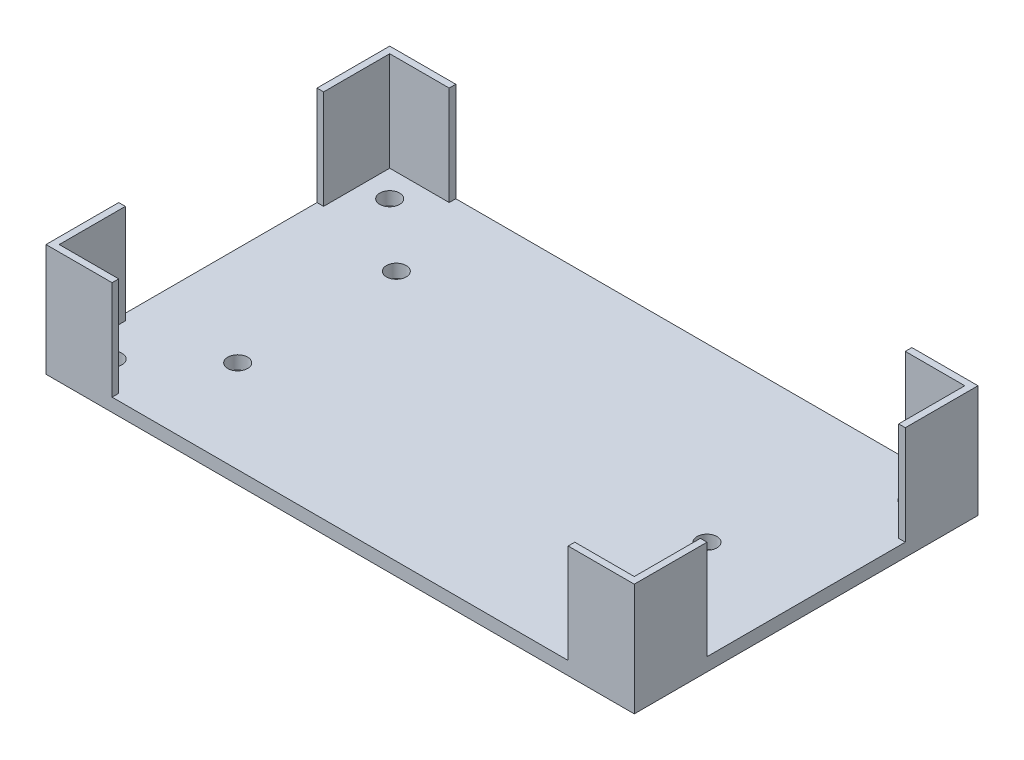
ISO-10303-21;
HEADER;
FILE_DESCRIPTION(('STEP AP214'),'2;1');
FILE_NAME('part.step','',(''),(''),'','','');
FILE_SCHEMA(('AUTOMOTIVE_DESIGN { 1 0 10303 214 1 1 1 1 }'));
ENDSEC;
DATA;
#1=APPLICATION_CONTEXT('core data for automotive mechanical design processes');
#2=APPLICATION_PROTOCOL_DEFINITION('international standard','automotive_design',2000,#1);
#3=PRODUCT_CONTEXT('',#1,'mechanical');
#4=PRODUCT('Part','Part','',(#3));
#5=PRODUCT_RELATED_PRODUCT_CATEGORY('part','',(#4));
#6=PRODUCT_DEFINITION_FORMATION('','',#4);
#7=PRODUCT_DEFINITION_CONTEXT('part definition',#1,'design');
#8=PRODUCT_DEFINITION('design','',#6,#7);
#9=PRODUCT_DEFINITION_SHAPE('','',#8);
#10=(LENGTH_UNIT() NAMED_UNIT(*) SI_UNIT(.MILLI.,.METRE.));
#11=(NAMED_UNIT(*) PLANE_ANGLE_UNIT() SI_UNIT($,.RADIAN.));
#12=(NAMED_UNIT(*) SI_UNIT($,.STERADIAN.) SOLID_ANGLE_UNIT());
#13=UNCERTAINTY_MEASURE_WITH_UNIT(LENGTH_MEASURE(1.E-05),#10,'distance_accuracy_value','');
#14=(GEOMETRIC_REPRESENTATION_CONTEXT(3) GLOBAL_UNCERTAINTY_ASSIGNED_CONTEXT((#13)) GLOBAL_UNIT_ASSIGNED_CONTEXT((#10,
#11,#12)) REPRESENTATION_CONTEXT('',''));
#15=CARTESIAN_POINT('',(0.,0.,0.));
#16=DIRECTION('',(0.,0.,1.));
#17=DIRECTION('',(1.,0.,0.));
#18=AXIS2_PLACEMENT_3D('',#15,#16,#17);
#19=CARTESIAN_POINT('',(0.,2.,0.));
#20=DIRECTION('',(0.,-1.,0.));
#21=DIRECTION('',(0.,0.,-1.));
#22=AXIS2_PLACEMENT_3D('',#19,#20,#21);
#23=PLANE('',#22);
#24=CARTESIAN_POINT('',(-55.229105330604,2.,34.2671371207063));
#25=DIRECTION('',(0.,1.,0.));
#26=DIRECTION('',(0.,0.,1.));
#27=AXIS2_PLACEMENT_3D('',#24,#25,#26);
#28=CIRCLE('',#27,1.5);
#29=CARTESIAN_POINT('',(-55.229105330604,2.,35.7671371207063));
#30=VERTEX_POINT('',#29);
#31=EDGE_CURVE('E417',#30,#30,#28,.T.);
#32=ORIENTED_EDGE('',*,*,#31,.F.);
#33=EDGE_LOOP('',(#32));
#34=FACE_BOUND('',#33,.T.);
#35=CARTESIAN_POINT('',(-55.229105330604,2.,-7.7328628792937));
#36=DIRECTION('',(0.,1.,0.));
#37=DIRECTION('',(0.,0.,1.));
#38=AXIS2_PLACEMENT_3D('',#35,#36,#37);
#39=CIRCLE('',#38,1.5);
#40=CARTESIAN_POINT('',(-55.229105330604,2.,-6.23286287929369));
#41=VERTEX_POINT('',#40);
#42=EDGE_CURVE('E418',#41,#41,#39,.T.);
#43=ORIENTED_EDGE('',*,*,#42,.F.);
#44=EDGE_LOOP('',(#43));
#45=FACE_BOUND('',#44,.T.);
#46=CARTESIAN_POINT('',(23.770894669396,2.,-7.7328628792937));
#47=DIRECTION('',(0.,1.,0.));
#48=DIRECTION('',(0.,0.,1.));
#49=AXIS2_PLACEMENT_3D('',#46,#47,#48);
#50=CIRCLE('',#49,1.5);
#51=CARTESIAN_POINT('',(23.770894669396,2.,-6.2328628792937));
#52=VERTEX_POINT('',#51);
#53=EDGE_CURVE('E424',#52,#52,#50,.T.);
#54=ORIENTED_EDGE('',*,*,#53,.F.);
#55=EDGE_LOOP('',(#54));
#56=FACE_BOUND('',#55,.T.);
#57=CARTESIAN_POINT('',(23.770894669396,2.,34.2671371207063));
#58=DIRECTION('',(0.,1.,0.));
#59=DIRECTION('',(0.,0.,1.));
#60=AXIS2_PLACEMENT_3D('',#57,#58,#59);
#61=CIRCLE('',#60,1.5);
#62=CARTESIAN_POINT('',(23.770894669396,2.,35.7671371207063));
#63=VERTEX_POINT('',#62);
#64=EDGE_CURVE('E399',#63,#63,#61,.T.);
#65=ORIENTED_EDGE('',*,*,#64,.F.);
#66=EDGE_LOOP('',(#65));
#67=FACE_BOUND('',#66,.T.);
#68=CARTESIAN_POINT('',(13.770894669396,2.,13.2671371207063));
#69=DIRECTION('',(0.,1.,0.));
#70=DIRECTION('',(0.,0.,1.));
#71=AXIS2_PLACEMENT_3D('',#68,#69,#70);
#72=CIRCLE('',#71,1.5);
#73=CARTESIAN_POINT('',(13.770894669396,2.,14.7671371207063));
#74=VERTEX_POINT('',#73);
#75=EDGE_CURVE('E393',#74,#74,#72,.T.);
#76=ORIENTED_EDGE('',*,*,#75,.F.);
#77=EDGE_LOOP('',(#76));
#78=FACE_BOUND('',#77,.T.);
#79=CARTESIAN_POINT('',(-45.229105330604,2.,1.2671371207063));
#80=DIRECTION('',(0.,1.,0.));
#81=DIRECTION('',(0.,0.,1.));
#82=AXIS2_PLACEMENT_3D('',#79,#80,#81);
#83=CIRCLE('',#82,1.5);
#84=CARTESIAN_POINT('',(-45.229105330604,2.,2.76713712070631));
#85=VERTEX_POINT('',#84);
#86=EDGE_CURVE('E406',#85,#85,#83,.T.);
#87=ORIENTED_EDGE('',*,*,#86,.F.);
#88=EDGE_LOOP('',(#87));
#89=FACE_BOUND('',#88,.T.);
#90=CARTESIAN_POINT('',(-45.229105330604,2.,25.2671371207063));
#91=DIRECTION('',(0.,1.,0.));
#92=DIRECTION('',(0.,0.,1.));
#93=AXIS2_PLACEMENT_3D('',#90,#91,#92);
#94=CIRCLE('',#93,1.5);
#95=CARTESIAN_POINT('',(-45.229105330604,2.,26.7671371207063));
#96=VERTEX_POINT('',#95);
#97=EDGE_CURVE('E400',#96,#96,#94,.T.);
#98=ORIENTED_EDGE('',*,*,#97,.F.);
#99=EDGE_LOOP('',(#98));
#100=FACE_BOUND('',#99,.T.);
#101=DIRECTION('',(0.,0.,1.));
#102=VECTOR('',#101,1.);
#103=CARTESIAN_POINT('',(-60.229105330604,2.,-12.7328628792937));
#104=LINE('',#103,#102);
#105=CARTESIAN_POINT('',(-60.229105330604,2.,-1.73286287929371));
#106=VERTEX_POINT('',#105);
#107=CARTESIAN_POINT('',(-60.229105330604,2.,28.2671371207063));
#108=VERTEX_POINT('',#107);
#109=EDGE_CURVE('E228',#106,#108,#104,.T.);
#110=ORIENTED_EDGE('',*,*,#109,.T.);
#111=DIRECTION('',(1.,0.,0.));
#112=VECTOR('',#111,1.);
#113=CARTESIAN_POINT('',(0.,2.,28.2671371207063));
#114=LINE('',#113,#112);
#115=CARTESIAN_POINT('',(-59.229105330604,2.,28.2671371207063));
#116=VERTEX_POINT('',#115);
#117=EDGE_CURVE('E72',#108,#116,#114,.T.);
#118=ORIENTED_EDGE('',*,*,#117,.T.);
#119=DIRECTION('',(0.,0.,-1.));
#120=VECTOR('',#119,1.);
#121=CARTESIAN_POINT('',(-59.229105330604,2.,0.));
#122=LINE('',#121,#120);
#123=CARTESIAN_POINT('',(-59.229105330604,2.,38.2671371207063));
#124=VERTEX_POINT('',#123);
#125=EDGE_CURVE('E262',#124,#116,#122,.T.);
#126=ORIENTED_EDGE('',*,*,#125,.F.);
#127=DIRECTION('',(1.,0.,0.));
#128=VECTOR('',#127,1.);
#129=CARTESIAN_POINT('',(-60.229105330604,2.,38.2671371207063));
#130=LINE('',#129,#128);
#131=CARTESIAN_POINT('',(-50.229105330604,2.,38.2671371207063));
#132=VERTEX_POINT('',#131);
#133=EDGE_CURVE('E78',#124,#132,#130,.T.);
#134=ORIENTED_EDGE('',*,*,#133,.T.);
#135=DIRECTION('',(0.,0.,-1.));
#136=VECTOR('',#135,1.);
#137=CARTESIAN_POINT('',(-50.229105330604,2.,39.2671371207063));
#138=LINE('',#137,#136);
#139=CARTESIAN_POINT('',(-50.229105330604,2.,39.2671371207063));
#140=VERTEX_POINT('',#139);
#141=EDGE_CURVE('E253',#140,#132,#138,.T.);
#142=ORIENTED_EDGE('',*,*,#141,.F.);
#143=DIRECTION('',(1.,0.,0.));
#144=VECTOR('',#143,1.);
#145=CARTESIAN_POINT('',(-60.229105330604,2.,39.2671371207063));
#146=LINE('',#145,#144);
#147=CARTESIAN_POINT('',(18.770894669396,2.,39.2671371207063));
#148=VERTEX_POINT('',#147);
#149=EDGE_CURVE('E438',#140,#148,#146,.T.);
#150=ORIENTED_EDGE('',*,*,#149,.T.);
#151=DIRECTION('',(0.,0.,-1.));
#152=VECTOR('',#151,1.);
#153=CARTESIAN_POINT('',(18.770894669396,2.,39.2671371207063));
#154=LINE('',#153,#152);
#155=CARTESIAN_POINT('',(18.770894669396,2.,38.2671371207063));
#156=VERTEX_POINT('',#155);
#157=EDGE_CURVE('E315',#148,#156,#154,.T.);
#158=ORIENTED_EDGE('',*,*,#157,.T.);
#159=DIRECTION('',(1.,0.,0.));
#160=VECTOR('',#159,1.);
#161=CARTESIAN_POINT('',(18.770894669396,2.,38.2671371207063));
#162=LINE('',#161,#160);
#163=CARTESIAN_POINT('',(27.770894669396,2.,38.2671371207063));
#164=VERTEX_POINT('',#163);
#165=EDGE_CURVE('E340',#156,#164,#162,.T.);
#166=ORIENTED_EDGE('',*,*,#165,.T.);
#167=DIRECTION('',(0.,0.,-1.));
#168=VECTOR('',#167,1.);
#169=CARTESIAN_POINT('',(27.770894669396,2.,38.2671371207063));
#170=LINE('',#169,#168);
#171=CARTESIAN_POINT('',(27.770894669396,2.,28.2671371207063));
#172=VERTEX_POINT('',#171);
#173=EDGE_CURVE('E321',#164,#172,#170,.T.);
#174=ORIENTED_EDGE('',*,*,#173,.T.);
#175=DIRECTION('',(1.,0.,0.));
#176=VECTOR('',#175,1.);
#177=CARTESIAN_POINT('',(27.770894669396,2.,28.2671371207063));
#178=LINE('',#177,#176);
#179=CARTESIAN_POINT('',(28.770894669396,2.,28.2671371207063));
#180=VERTEX_POINT('',#179);
#181=EDGE_CURVE('E324',#172,#180,#178,.T.);
#182=ORIENTED_EDGE('',*,*,#181,.T.);
#183=DIRECTION('',(0.,0.,1.));
#184=VECTOR('',#183,1.);
#185=CARTESIAN_POINT('',(28.770894669396,2.,-12.7328628792937));
#186=LINE('',#185,#184);
#187=CARTESIAN_POINT('',(28.770894669396,2.,-1.7328628792937));
#188=VERTEX_POINT('',#187);
#189=EDGE_CURVE('E440',#188,#180,#186,.T.);
#190=ORIENTED_EDGE('',*,*,#189,.F.);
#191=DIRECTION('',(1.,0.,0.));
#192=VECTOR('',#191,1.);
#193=CARTESIAN_POINT('',(27.770894669396,2.,-1.7328628792937));
#194=LINE('',#193,#192);
#195=CARTESIAN_POINT('',(27.770894669396,2.,-1.7328628792937));
#196=VERTEX_POINT('',#195);
#197=EDGE_CURVE('E328',#196,#188,#194,.T.);
#198=ORIENTED_EDGE('',*,*,#197,.F.);
#199=DIRECTION('',(0.,0.,-1.));
#200=VECTOR('',#199,1.);
#201=CARTESIAN_POINT('',(27.770894669396,2.,-1.7328628792937));
#202=LINE('',#201,#200);
#203=CARTESIAN_POINT('',(27.770894669396,2.,-11.7328628792937));
#204=VERTEX_POINT('',#203);
#205=EDGE_CURVE('E382',#196,#204,#202,.T.);
#206=ORIENTED_EDGE('',*,*,#205,.T.);
#207=DIRECTION('',(1.,0.,0.));
#208=VECTOR('',#207,1.);
#209=CARTESIAN_POINT('',(0.,2.,-11.7328628792937));
#210=LINE('',#209,#208);
#211=CARTESIAN_POINT('',(18.770894669396,2.,-11.7328628792937));
#212=VERTEX_POINT('',#211);
#213=EDGE_CURVE('E357',#212,#204,#210,.T.);
#214=ORIENTED_EDGE('',*,*,#213,.F.);
#215=DIRECTION('',(0.,0.,-1.));
#216=VECTOR('',#215,1.);
#217=CARTESIAN_POINT('',(18.770894669396,2.,0.));
#218=LINE('',#217,#216);
#219=CARTESIAN_POINT('',(18.7708946693959,2.,-12.7328628792937));
#220=VERTEX_POINT('',#219);
#221=EDGE_CURVE('E366',#212,#220,#218,.T.);
#222=ORIENTED_EDGE('',*,*,#221,.T.);
#223=DIRECTION('',(1.,0.,0.));
#224=VECTOR('',#223,1.);
#225=CARTESIAN_POINT('',(-60.229105330604,2.,-12.7328628792937));
#226=LINE('',#225,#224);
#227=CARTESIAN_POINT('',(-50.229105330604,2.,-12.7328628792937));
#228=VERTEX_POINT('',#227);
#229=EDGE_CURVE('E443',#228,#220,#226,.T.);
#230=ORIENTED_EDGE('',*,*,#229,.F.);
#231=DIRECTION('',(0.,0.,-1.));
#232=VECTOR('',#231,1.);
#233=CARTESIAN_POINT('',(-50.229105330604,2.,-11.7328628792937));
#234=LINE('',#233,#232);
#235=CARTESIAN_POINT('',(-50.229105330604,2.,-11.7328628792937));
#236=VERTEX_POINT('',#235);
#237=EDGE_CURVE('E279',#236,#228,#234,.T.);
#238=ORIENTED_EDGE('',*,*,#237,.F.);
#239=DIRECTION('',(1.,0.,0.));
#240=VECTOR('',#239,1.);
#241=CARTESIAN_POINT('',(-60.229105330604,2.,-11.7328628792937));
#242=LINE('',#241,#240);
#243=CARTESIAN_POINT('',(-59.229105330604,2.,-11.7328628792937));
#244=VERTEX_POINT('',#243);
#245=EDGE_CURVE('E276',#244,#236,#242,.T.);
#246=ORIENTED_EDGE('',*,*,#245,.F.);
#247=DIRECTION('',(0.,0.,-1.));
#248=VECTOR('',#247,1.);
#249=CARTESIAN_POINT('',(-59.229105330604,2.,-1.7328628792937));
#250=LINE('',#249,#248);
#251=CARTESIAN_POINT('',(-59.229105330604,2.,-1.7328628792937));
#252=VERTEX_POINT('',#251);
#253=EDGE_CURVE('E302',#252,#244,#250,.T.);
#254=ORIENTED_EDGE('',*,*,#253,.F.);
#255=DIRECTION('',(1.,0.,0.));
#256=VECTOR('',#255,1.);
#257=CARTESIAN_POINT('',(-60.229105330604,2.,-1.7328628792937));
#258=LINE('',#257,#256);
#259=EDGE_CURVE('E275',#106,#252,#258,.T.);
#260=ORIENTED_EDGE('',*,*,#259,.F.);
#261=EDGE_LOOP('',(#110,#118,#126,#134,#142,#150,#158,#166,#174,#182,#190,#198,#206,#214,#222,
#230,#238,#246,#254,#260));
#262=FACE_BOUND('',#261,.T.);
#263=ADVANCED_FACE('F57',(#34,#45,#56,#67,#78,#89,#100,#262),#23,.F.);
#264=CARTESIAN_POINT('',(-60.229105330604,2.,39.2671371207063));
#265=DIRECTION('',(0.,0.,-1.));
#266=DIRECTION('',(-1.,0.,0.));
#267=AXIS2_PLACEMENT_3D('',#264,#265,#266);
#268=PLANE('',#267);
#269=DIRECTION('',(1.,0.,0.));
#270=VECTOR('',#269,1.);
#271=CARTESIAN_POINT('',(-60.229105330604,0.,39.2671371207063));
#272=LINE('',#271,#270);
#273=CARTESIAN_POINT('',(-60.229105330604,0.,39.2671371207063));
#274=VERTEX_POINT('',#273);
#275=CARTESIAN_POINT('',(28.770894669396,0.,39.2671371207063));
#276=VERTEX_POINT('',#275);
#277=EDGE_CURVE('E435',#274,#276,#272,.T.);
#278=ORIENTED_EDGE('',*,*,#277,.T.);
#279=DIRECTION('',(0.,-1.,0.));
#280=VECTOR('',#279,1.);
#281=CARTESIAN_POINT('',(28.770894669396,2.,39.2671371207063));
#282=LINE('',#281,#280);
#283=CARTESIAN_POINT('',(28.770894669396,17.,39.2671371207063));
#284=VERTEX_POINT('',#283);
#285=EDGE_CURVE('E12',#284,#276,#282,.T.);
#286=ORIENTED_EDGE('',*,*,#285,.F.);
#287=DIRECTION('',(1.,0.,0.));
#288=VECTOR('',#287,1.);
#289=CARTESIAN_POINT('',(18.770894669396,17.,39.2671371207063));
#290=LINE('',#289,#288);
#291=CARTESIAN_POINT('',(18.770894669396,17.,39.2671371207063));
#292=VERTEX_POINT('',#291);
#293=EDGE_CURVE('E337',#292,#284,#290,.T.);
#294=ORIENTED_EDGE('',*,*,#293,.F.);
#295=DIRECTION('',(0.,-1.,0.));
#296=VECTOR('',#295,1.);
#297=CARTESIAN_POINT('',(18.770894669396,17.,39.2671371207063));
#298=LINE('',#297,#296);
#299=EDGE_CURVE('E320',#292,#148,#298,.T.);
#300=ORIENTED_EDGE('',*,*,#299,.T.);
#301=ORIENTED_EDGE('',*,*,#149,.F.);
#302=DIRECTION('',(0.,-1.,0.));
#303=VECTOR('',#302,1.);
#304=CARTESIAN_POINT('',(-50.229105330604,17.,39.2671371207063));
#305=LINE('',#304,#303);
#306=CARTESIAN_POINT('',(-50.229105330604,17.,39.2671371207063));
#307=VERTEX_POINT('',#306);
#308=EDGE_CURVE('E234',#307,#140,#305,.T.);
#309=ORIENTED_EDGE('',*,*,#308,.F.);
#310=DIRECTION('',(1.,0.,0.));
#311=VECTOR('',#310,1.);
#312=CARTESIAN_POINT('',(-60.229105330604,17.,39.2671371207063));
#313=LINE('',#312,#311);
#314=CARTESIAN_POINT('',(-60.229105330604,17.,39.2671371207063));
#315=VERTEX_POINT('',#314);
#316=EDGE_CURVE('E231',#315,#307,#313,.T.);
#317=ORIENTED_EDGE('',*,*,#316,.F.);
#318=DIRECTION('',(0.,-1.,0.));
#319=VECTOR('',#318,1.);
#320=CARTESIAN_POINT('',(-60.229105330604,2.,39.2671371207063));
#321=LINE('',#320,#319);
#322=EDGE_CURVE('E215',#315,#274,#321,.T.);
#323=ORIENTED_EDGE('',*,*,#322,.T.);
#324=EDGE_LOOP('',(#278,#286,#294,#300,#301,#309,#317,#323));
#325=FACE_BOUND('',#324,.T.);
#326=ADVANCED_FACE('F59',(#325),#268,.F.);
#327=CARTESIAN_POINT('',(28.770894669396,2.,-12.7328628792937));
#328=DIRECTION('',(1.,0.,0.));
#329=DIRECTION('',(0.,0.,-1.));
#330=AXIS2_PLACEMENT_3D('',#327,#328,#329);
#331=PLANE('',#330);
#332=DIRECTION('',(0.,0.,1.));
#333=VECTOR('',#332,1.);
#334=CARTESIAN_POINT('',(28.770894669396,0.,-12.7328628792937));
#335=LINE('',#334,#333);
#336=CARTESIAN_POINT('',(28.770894669396,0.,-12.7328628792937));
#337=VERTEX_POINT('',#336);
#338=EDGE_CURVE('E447',#337,#276,#335,.T.);
#339=ORIENTED_EDGE('',*,*,#338,.F.);
#340=DIRECTION('',(0.,-1.,0.));
#341=VECTOR('',#340,1.);
#342=CARTESIAN_POINT('',(28.770894669396,2.,-12.7328628792937));
#343=LINE('',#342,#341);
#344=CARTESIAN_POINT('',(28.770894669396,17.,-12.7328628792937));
#345=VERTEX_POINT('',#344);
#346=EDGE_CURVE('E65',#345,#337,#343,.T.);
#347=ORIENTED_EDGE('',*,*,#346,.F.);
#348=DIRECTION('',(0.,0.,-1.));
#349=VECTOR('',#348,1.);
#350=CARTESIAN_POINT('',(28.770894669396,17.,0.));
#351=LINE('',#350,#349);
#352=CARTESIAN_POINT('',(28.770894669396,17.,-1.7328628792937));
#353=VERTEX_POINT('',#352);
#354=EDGE_CURVE('E360',#353,#345,#351,.T.);
#355=ORIENTED_EDGE('',*,*,#354,.F.);
#356=DIRECTION('',(0.,-1.,0.));
#357=VECTOR('',#356,1.);
#358=CARTESIAN_POINT('',(28.770894669396,17.,-1.7328628792937));
#359=LINE('',#358,#357);
#360=EDGE_CURVE('E369',#353,#188,#359,.T.);
#361=ORIENTED_EDGE('',*,*,#360,.T.);
#362=ORIENTED_EDGE('',*,*,#189,.T.);
#363=DIRECTION('',(0.,-1.,0.));
#364=VECTOR('',#363,1.);
#365=CARTESIAN_POINT('',(28.770894669396,17.,28.2671371207063));
#366=LINE('',#365,#364);
#367=CARTESIAN_POINT('',(28.770894669396,17.,28.2671371207063));
#368=VERTEX_POINT('',#367);
#369=EDGE_CURVE('E312',#368,#180,#366,.T.);
#370=ORIENTED_EDGE('',*,*,#369,.F.);
#371=DIRECTION('',(0.,0.,-1.));
#372=VECTOR('',#371,1.);
#373=CARTESIAN_POINT('',(28.770894669396,17.,38.2671371207063));
#374=LINE('',#373,#372);
#375=EDGE_CURVE('E325',#284,#368,#374,.T.);
#376=ORIENTED_EDGE('',*,*,#375,.F.);
#377=ORIENTED_EDGE('',*,*,#285,.T.);
#378=EDGE_LOOP('',(#339,#347,#355,#361,#362,#370,#376,#377));
#379=FACE_BOUND('',#378,.T.);
#380=ADVANCED_FACE('F461',(#379),#331,.T.);
#381=CARTESIAN_POINT('',(-60.229105330604,2.,-12.7328628792937));
#382=DIRECTION('',(0.,0.,-1.));
#383=DIRECTION('',(-1.,0.,0.));
#384=AXIS2_PLACEMENT_3D('',#381,#382,#383);
#385=PLANE('',#384);
#386=DIRECTION('',(1.,0.,0.));
#387=VECTOR('',#386,1.);
#388=CARTESIAN_POINT('',(-60.229105330604,0.,-12.7328628792937));
#389=LINE('',#388,#387);
#390=CARTESIAN_POINT('',(-60.229105330604,0.,-12.7328628792937));
#391=VERTEX_POINT('',#390);
#392=EDGE_CURVE('E450',#391,#337,#389,.T.);
#393=ORIENTED_EDGE('',*,*,#392,.F.);
#394=DIRECTION('',(0.,-1.,0.));
#395=VECTOR('',#394,1.);
#396=CARTESIAN_POINT('',(-60.229105330604,2.,-12.7328628792937));
#397=LINE('',#396,#395);
#398=CARTESIAN_POINT('',(-60.229105330604,17.,-12.7328628792937));
#399=VERTEX_POINT('',#398);
#400=EDGE_CURVE('E227',#399,#391,#397,.T.);
#401=ORIENTED_EDGE('',*,*,#400,.F.);
#402=DIRECTION('',(1.,0.,0.));
#403=VECTOR('',#402,1.);
#404=CARTESIAN_POINT('',(-60.229105330604,17.,-12.7328628792937));
#405=LINE('',#404,#403);
#406=CARTESIAN_POINT('',(-50.229105330604,17.,-12.7328628792937));
#407=VERTEX_POINT('',#406);
#408=EDGE_CURVE('E287',#399,#407,#405,.T.);
#409=ORIENTED_EDGE('',*,*,#408,.T.);
#410=DIRECTION('',(0.,-1.,0.));
#411=VECTOR('',#410,1.);
#412=CARTESIAN_POINT('',(-50.229105330604,17.,-12.7328628792937));
#413=LINE('',#412,#411);
#414=EDGE_CURVE('E268',#407,#228,#413,.T.);
#415=ORIENTED_EDGE('',*,*,#414,.T.);
#416=ORIENTED_EDGE('',*,*,#229,.T.);
#417=DIRECTION('',(0.,-1.,0.));
#418=VECTOR('',#417,1.);
#419=CARTESIAN_POINT('',(18.770894669396,17.,-12.7328628792937));
#420=LINE('',#419,#418);
#421=CARTESIAN_POINT('',(18.770894669396,17.,-12.7328628792937));
#422=VERTEX_POINT('',#421);
#423=EDGE_CURVE('E365',#422,#220,#420,.T.);
#424=ORIENTED_EDGE('',*,*,#423,.F.);
#425=DIRECTION('',(-1.,0.,0.));
#426=VECTOR('',#425,1.);
#427=CARTESIAN_POINT('',(0.,17.,-12.7328628792937));
#428=LINE('',#427,#426);
#429=EDGE_CURVE('E363',#345,#422,#428,.T.);
#430=ORIENTED_EDGE('',*,*,#429,.F.);
#431=ORIENTED_EDGE('',*,*,#346,.T.);
#432=EDGE_LOOP('',(#393,#401,#409,#415,#416,#424,#430,#431));
#433=FACE_BOUND('',#432,.T.);
#434=ADVANCED_FACE('F458',(#433),#385,.T.);
#435=CARTESIAN_POINT('',(-60.229105330604,2.,-12.7328628792937));
#436=DIRECTION('',(1.,0.,0.));
#437=DIRECTION('',(0.,0.,-1.));
#438=AXIS2_PLACEMENT_3D('',#435,#436,#437);
#439=PLANE('',#438);
#440=DIRECTION('',(0.,0.,1.));
#441=VECTOR('',#440,1.);
#442=CARTESIAN_POINT('',(-60.229105330604,0.,-12.7328628792937));
#443=LINE('',#442,#441);
#444=EDGE_CURVE('E223',#391,#274,#443,.T.);
#445=ORIENTED_EDGE('',*,*,#444,.T.);
#446=ORIENTED_EDGE('',*,*,#322,.F.);
#447=DIRECTION('',(0.,0.,-1.));
#448=VECTOR('',#447,1.);
#449=CARTESIAN_POINT('',(-60.229105330604,17.,39.2671371207063));
#450=LINE('',#449,#448);
#451=CARTESIAN_POINT('',(-60.229105330604,17.,28.2671371207063));
#452=VERTEX_POINT('',#451);
#453=EDGE_CURVE('E220',#315,#452,#450,.T.);
#454=ORIENTED_EDGE('',*,*,#453,.T.);
#455=DIRECTION('',(0.,-1.,0.));
#456=VECTOR('',#455,1.);
#457=CARTESIAN_POINT('',(-60.229105330604,17.,28.2671371207063));
#458=LINE('',#457,#456);
#459=EDGE_CURVE('E259',#452,#108,#458,.T.);
#460=ORIENTED_EDGE('',*,*,#459,.T.);
#461=ORIENTED_EDGE('',*,*,#109,.F.);
#462=DIRECTION('',(0.,-1.,0.));
#463=VECTOR('',#462,1.);
#464=CARTESIAN_POINT('',(-60.229105330604,17.,-1.7328628792937));
#465=LINE('',#464,#463);
#466=CARTESIAN_POINT('',(-60.229105330604,17.,-1.7328628792937));
#467=VERTEX_POINT('',#466);
#468=EDGE_CURVE('E298',#467,#106,#465,.T.);
#469=ORIENTED_EDGE('',*,*,#468,.F.);
#470=DIRECTION('',(0.,0.,-1.));
#471=VECTOR('',#470,1.);
#472=CARTESIAN_POINT('',(-60.229105330604,17.,-11.7328628792937));
#473=LINE('',#472,#471);
#474=EDGE_CURVE('E280',#467,#399,#473,.T.);
#475=ORIENTED_EDGE('',*,*,#474,.T.);
#476=ORIENTED_EDGE('',*,*,#400,.T.);
#477=EDGE_LOOP('',(#445,#446,#454,#460,#461,#469,#475,#476));
#478=FACE_BOUND('',#477,.T.);
#479=ADVANCED_FACE('F217',(#478),#439,.F.);
#480=CARTESIAN_POINT('',(0.,0.,0.));
#481=DIRECTION('',(0.,-1.,0.));
#482=DIRECTION('',(0.,0.,-1.));
#483=AXIS2_PLACEMENT_3D('',#480,#481,#482);
#484=PLANE('',#483);
#485=CARTESIAN_POINT('',(-45.229105330604,0.,25.2671371207063));
#486=DIRECTION('',(0.,1.,0.));
#487=DIRECTION('',(0.,0.,1.));
#488=AXIS2_PLACEMENT_3D('',#485,#486,#487);
#489=CIRCLE('',#488,1.5);
#490=CARTESIAN_POINT('',(-45.229105330604,0.,26.7671371207063));
#491=VERTEX_POINT('',#490);
#492=EDGE_CURVE('E396',#491,#491,#489,.T.);
#493=ORIENTED_EDGE('',*,*,#492,.T.);
#494=EDGE_LOOP('',(#493));
#495=FACE_BOUND('',#494,.T.);
#496=CARTESIAN_POINT('',(-45.229105330604,0.,1.2671371207063));
#497=DIRECTION('',(0.,1.,0.));
#498=DIRECTION('',(0.,0.,1.));
#499=AXIS2_PLACEMENT_3D('',#496,#497,#498);
#500=CIRCLE('',#499,1.5);
#501=CARTESIAN_POINT('',(-45.229105330604,0.,2.76713712070631));
#502=VERTEX_POINT('',#501);
#503=EDGE_CURVE('E403',#502,#502,#500,.T.);
#504=ORIENTED_EDGE('',*,*,#503,.T.);
#505=EDGE_LOOP('',(#504));
#506=FACE_BOUND('',#505,.T.);
#507=CARTESIAN_POINT('',(13.770894669396,0.,13.2671371207063));
#508=DIRECTION('',(0.,1.,0.));
#509=DIRECTION('',(0.,0.,1.));
#510=AXIS2_PLACEMENT_3D('',#507,#508,#509);
#511=CIRCLE('',#510,1.5);
#512=CARTESIAN_POINT('',(13.770894669396,0.,14.7671371207063));
#513=VERTEX_POINT('',#512);
#514=EDGE_CURVE('E409',#513,#513,#511,.T.);
#515=ORIENTED_EDGE('',*,*,#514,.T.);
#516=EDGE_LOOP('',(#515));
#517=FACE_BOUND('',#516,.T.);
#518=CARTESIAN_POINT('',(23.770894669396,0.,34.2671371207063));
#519=DIRECTION('',(0.,1.,0.));
#520=DIRECTION('',(0.,0.,1.));
#521=AXIS2_PLACEMENT_3D('',#518,#519,#520);
#522=CIRCLE('',#521,1.5);
#523=CARTESIAN_POINT('',(23.770894669396,0.,35.7671371207063));
#524=VERTEX_POINT('',#523);
#525=EDGE_CURVE('E427',#524,#524,#522,.T.);
#526=ORIENTED_EDGE('',*,*,#525,.T.);
#527=EDGE_LOOP('',(#526));
#528=FACE_BOUND('',#527,.T.);
#529=CARTESIAN_POINT('',(23.770894669396,0.,-7.7328628792937));
#530=DIRECTION('',(0.,1.,0.));
#531=DIRECTION('',(0.,0.,1.));
#532=AXIS2_PLACEMENT_3D('',#529,#530,#531);
#533=CIRCLE('',#532,1.5);
#534=CARTESIAN_POINT('',(23.770894669396,0.,-6.2328628792937));
#535=VERTEX_POINT('',#534);
#536=EDGE_CURVE('E421',#535,#535,#533,.T.);
#537=ORIENTED_EDGE('',*,*,#536,.T.);
#538=EDGE_LOOP('',(#537));
#539=FACE_BOUND('',#538,.T.);
#540=CARTESIAN_POINT('',(-55.229105330604,0.,-7.7328628792937));
#541=DIRECTION('',(0.,1.,0.));
#542=DIRECTION('',(0.,0.,1.));
#543=AXIS2_PLACEMENT_3D('',#540,#541,#542);
#544=CIRCLE('',#543,1.5);
#545=CARTESIAN_POINT('',(-55.229105330604,0.,-6.23286287929369));
#546=VERTEX_POINT('',#545);
#547=EDGE_CURVE('E414',#546,#546,#544,.T.);
#548=ORIENTED_EDGE('',*,*,#547,.T.);
#549=EDGE_LOOP('',(#548));
#550=FACE_BOUND('',#549,.T.);
#551=CARTESIAN_POINT('',(-55.229105330604,0.,34.2671371207063));
#552=DIRECTION('',(0.,1.,0.));
#553=DIRECTION('',(0.,0.,1.));
#554=AXIS2_PLACEMENT_3D('',#551,#552,#553);
#555=CIRCLE('',#554,1.5);
#556=CARTESIAN_POINT('',(-55.229105330604,0.,35.7671371207063));
#557=VERTEX_POINT('',#556);
#558=EDGE_CURVE('E432',#557,#557,#555,.T.);
#559=ORIENTED_EDGE('',*,*,#558,.T.);
#560=EDGE_LOOP('',(#559));
#561=FACE_BOUND('',#560,.T.);
#562=ORIENTED_EDGE('',*,*,#277,.F.);
#563=ORIENTED_EDGE('',*,*,#444,.F.);
#564=ORIENTED_EDGE('',*,*,#392,.T.);
#565=ORIENTED_EDGE('',*,*,#338,.T.);
#566=EDGE_LOOP('',(#562,#563,#564,#565));
#567=FACE_BOUND('',#566,.T.);
#568=ADVANCED_FACE('F464',(#495,#506,#517,#528,#539,#550,#561,#567),#484,.T.);
#569=CARTESIAN_POINT('',(-55.229105330604,0.,34.2671371207063));
#570=DIRECTION('',(0.,1.,0.));
#571=DIRECTION('',(0.,0.,1.));
#572=AXIS2_PLACEMENT_3D('',#569,#570,#571);
#573=CYLINDRICAL_SURFACE('',#572,1.5);
#574=ORIENTED_EDGE('',*,*,#558,.F.);
#575=EDGE_LOOP('',(#574));
#576=FACE_BOUND('',#575,.T.);
#577=ORIENTED_EDGE('',*,*,#31,.T.);
#578=EDGE_LOOP('',(#577));
#579=FACE_BOUND('',#578,.T.);
#580=ADVANCED_FACE('F528',(#576,#579),#573,.F.);
#581=CARTESIAN_POINT('',(-55.229105330604,0.,-7.7328628792937));
#582=DIRECTION('',(0.,1.,0.));
#583=DIRECTION('',(0.,0.,1.));
#584=AXIS2_PLACEMENT_3D('',#581,#582,#583);
#585=CYLINDRICAL_SURFACE('',#584,1.5);
#586=ORIENTED_EDGE('',*,*,#547,.F.);
#587=EDGE_LOOP('',(#586));
#588=FACE_BOUND('',#587,.T.);
#589=ORIENTED_EDGE('',*,*,#42,.T.);
#590=EDGE_LOOP('',(#589));
#591=FACE_BOUND('',#590,.T.);
#592=ADVANCED_FACE('F562',(#588,#591),#585,.F.);
#593=CARTESIAN_POINT('',(23.770894669396,0.,-7.7328628792937));
#594=DIRECTION('',(0.,1.,0.));
#595=DIRECTION('',(0.,0.,1.));
#596=AXIS2_PLACEMENT_3D('',#593,#594,#595);
#597=CYLINDRICAL_SURFACE('',#596,1.5);
#598=ORIENTED_EDGE('',*,*,#536,.F.);
#599=EDGE_LOOP('',(#598));
#600=FACE_BOUND('',#599,.T.);
#601=ORIENTED_EDGE('',*,*,#53,.T.);
#602=EDGE_LOOP('',(#601));
#603=FACE_BOUND('',#602,.T.);
#604=ADVANCED_FACE('F569',(#600,#603),#597,.F.);
#605=CARTESIAN_POINT('',(23.770894669396,0.,34.2671371207063));
#606=DIRECTION('',(0.,1.,0.));
#607=DIRECTION('',(0.,0.,1.));
#608=AXIS2_PLACEMENT_3D('',#605,#606,#607);
#609=CYLINDRICAL_SURFACE('',#608,1.5);
#610=ORIENTED_EDGE('',*,*,#525,.F.);
#611=EDGE_LOOP('',(#610));
#612=FACE_BOUND('',#611,.T.);
#613=ORIENTED_EDGE('',*,*,#64,.T.);
#614=EDGE_LOOP('',(#613));
#615=FACE_BOUND('',#614,.T.);
#616=ADVANCED_FACE('F577',(#612,#615),#609,.F.);
#617=CARTESIAN_POINT('',(13.770894669396,0.,13.2671371207063));
#618=DIRECTION('',(0.,1.,0.));
#619=DIRECTION('',(0.,0.,1.));
#620=AXIS2_PLACEMENT_3D('',#617,#618,#619);
#621=CYLINDRICAL_SURFACE('',#620,1.5);
#622=ORIENTED_EDGE('',*,*,#514,.F.);
#623=EDGE_LOOP('',(#622));
#624=FACE_BOUND('',#623,.T.);
#625=ORIENTED_EDGE('',*,*,#75,.T.);
#626=EDGE_LOOP('',(#625));
#627=FACE_BOUND('',#626,.T.);
#628=ADVANCED_FACE('F584',(#624,#627),#621,.F.);
#629=CARTESIAN_POINT('',(-45.229105330604,0.,1.2671371207063));
#630=DIRECTION('',(0.,1.,0.));
#631=DIRECTION('',(0.,0.,1.));
#632=AXIS2_PLACEMENT_3D('',#629,#630,#631);
#633=CYLINDRICAL_SURFACE('',#632,1.5);
#634=ORIENTED_EDGE('',*,*,#503,.F.);
#635=EDGE_LOOP('',(#634));
#636=FACE_BOUND('',#635,.T.);
#637=ORIENTED_EDGE('',*,*,#86,.T.);
#638=EDGE_LOOP('',(#637));
#639=FACE_BOUND('',#638,.T.);
#640=ADVANCED_FACE('F590',(#636,#639),#633,.F.);
#641=CARTESIAN_POINT('',(-45.229105330604,0.,25.2671371207063));
#642=DIRECTION('',(0.,1.,0.));
#643=DIRECTION('',(0.,0.,1.));
#644=AXIS2_PLACEMENT_3D('',#641,#642,#643);
#645=CYLINDRICAL_SURFACE('',#644,1.5);
#646=ORIENTED_EDGE('',*,*,#492,.F.);
#647=EDGE_LOOP('',(#646));
#648=FACE_BOUND('',#647,.T.);
#649=ORIENTED_EDGE('',*,*,#97,.T.);
#650=EDGE_LOOP('',(#649));
#651=FACE_BOUND('',#650,.T.);
#652=ADVANCED_FACE('F598',(#648,#651),#645,.F.);
#653=CARTESIAN_POINT('',(0.,17.,-11.7328628792937));
#654=DIRECTION('',(0.,0.,-1.));
#655=DIRECTION('',(-1.,0.,0.));
#656=AXIS2_PLACEMENT_3D('',#653,#654,#655);
#657=PLANE('',#656);
#658=DIRECTION('',(0.,-1.,0.));
#659=VECTOR('',#658,1.);
#660=CARTESIAN_POINT('',(27.770894669396,17.,-11.7328628792937));
#661=LINE('',#660,#659);
#662=CARTESIAN_POINT('',(27.770894669396,17.,-11.7328628792937));
#663=VERTEX_POINT('',#662);
#664=EDGE_CURVE('E377',#663,#204,#661,.T.);
#665=ORIENTED_EDGE('',*,*,#664,.F.);
#666=DIRECTION('',(1.,0.,0.));
#667=VECTOR('',#666,1.);
#668=CARTESIAN_POINT('',(0.,17.,-11.7328628792937));
#669=LINE('',#668,#667);
#670=CARTESIAN_POINT('',(18.770894669396,17.,-11.7328628792937));
#671=VERTEX_POINT('',#670);
#672=EDGE_CURVE('E356',#671,#663,#669,.T.);
#673=ORIENTED_EDGE('',*,*,#672,.F.);
#674=DIRECTION('',(0.,-1.,0.));
#675=VECTOR('',#674,1.);
#676=CARTESIAN_POINT('',(18.770894669396,17.,-11.7328628792937));
#677=LINE('',#676,#675);
#678=EDGE_CURVE('E374',#671,#212,#677,.T.);
#679=ORIENTED_EDGE('',*,*,#678,.T.);
#680=ORIENTED_EDGE('',*,*,#213,.T.);
#681=EDGE_LOOP('',(#665,#673,#679,#680));
#682=FACE_BOUND('',#681,.T.);
#683=ADVANCED_FACE('F606',(#682),#657,.F.);
#684=CARTESIAN_POINT('',(18.770894669396,17.,0.));
#685=DIRECTION('',(-1.,0.,0.));
#686=DIRECTION('',(0.,0.,1.));
#687=AXIS2_PLACEMENT_3D('',#684,#685,#686);
#688=PLANE('',#687);
#689=ORIENTED_EDGE('',*,*,#221,.F.);
#690=ORIENTED_EDGE('',*,*,#678,.F.);
#691=DIRECTION('',(0.,0.,-1.));
#692=VECTOR('',#691,1.);
#693=CARTESIAN_POINT('',(18.770894669396,17.,0.));
#694=LINE('',#693,#692);
#695=EDGE_CURVE('E353',#671,#422,#694,.T.);
#696=ORIENTED_EDGE('',*,*,#695,.T.);
#697=ORIENTED_EDGE('',*,*,#423,.T.);
#698=EDGE_LOOP('',(#689,#690,#696,#697));
#699=FACE_BOUND('',#698,.T.);
#700=ADVANCED_FACE('F614',(#699),#688,.T.);
#701=CARTESIAN_POINT('',(0.,17.,0.));
#702=DIRECTION('',(0.,1.,0.));
#703=DIRECTION('',(0.,0.,1.));
#704=AXIS2_PLACEMENT_3D('',#701,#702,#703);
#705=PLANE('',#704);
#706=ORIENTED_EDGE('',*,*,#695,.F.);
#707=ORIENTED_EDGE('',*,*,#672,.T.);
#708=DIRECTION('',(0.,0.,-1.));
#709=VECTOR('',#708,1.);
#710=CARTESIAN_POINT('',(27.770894669396,17.,-1.7328628792937));
#711=LINE('',#710,#709);
#712=CARTESIAN_POINT('',(27.770894669396,17.,-1.7328628792937));
#713=VERTEX_POINT('',#712);
#714=EDGE_CURVE('E381',#713,#663,#711,.T.);
#715=ORIENTED_EDGE('',*,*,#714,.F.);
#716=DIRECTION('',(1.,0.,0.));
#717=VECTOR('',#716,1.);
#718=CARTESIAN_POINT('',(27.770894669396,17.,-1.7328628792937));
#719=LINE('',#718,#717);
#720=EDGE_CURVE('E378',#713,#353,#719,.T.);
#721=ORIENTED_EDGE('',*,*,#720,.T.);
#722=ORIENTED_EDGE('',*,*,#354,.T.);
#723=ORIENTED_EDGE('',*,*,#429,.T.);
#724=EDGE_LOOP('',(#706,#707,#715,#721,#722,#723));
#725=FACE_BOUND('',#724,.T.);
#726=ADVANCED_FACE('F623',(#725),#705,.T.);
#727=CARTESIAN_POINT('',(27.770894669396,17.,-1.7328628792937));
#728=DIRECTION('',(0.,0.,-1.));
#729=DIRECTION('',(-1.,0.,0.));
#730=AXIS2_PLACEMENT_3D('',#727,#728,#729);
#731=PLANE('',#730);
#732=ORIENTED_EDGE('',*,*,#197,.T.);
#733=ORIENTED_EDGE('',*,*,#360,.F.);
#734=ORIENTED_EDGE('',*,*,#720,.F.);
#735=DIRECTION('',(0.,-1.,0.));
#736=VECTOR('',#735,1.);
#737=CARTESIAN_POINT('',(27.770894669396,17.,-1.7328628792937));
#738=LINE('',#737,#736);
#739=EDGE_CURVE('E385',#713,#196,#738,.T.);
#740=ORIENTED_EDGE('',*,*,#739,.T.);
#741=EDGE_LOOP('',(#732,#733,#734,#740));
#742=FACE_BOUND('',#741,.T.);
#743=ADVANCED_FACE('F609',(#742),#731,.F.);
#744=CARTESIAN_POINT('',(27.770894669396,17.,-1.7328628792937));
#745=DIRECTION('',(-1.,0.,0.));
#746=DIRECTION('',(0.,0.,1.));
#747=AXIS2_PLACEMENT_3D('',#744,#745,#746);
#748=PLANE('',#747);
#749=ORIENTED_EDGE('',*,*,#205,.F.);
#750=ORIENTED_EDGE('',*,*,#739,.F.);
#751=ORIENTED_EDGE('',*,*,#714,.T.);
#752=ORIENTED_EDGE('',*,*,#664,.T.);
#753=EDGE_LOOP('',(#749,#750,#751,#752));
#754=FACE_BOUND('',#753,.T.);
#755=ADVANCED_FACE('F617',(#754),#748,.T.);
#756=CARTESIAN_POINT('',(18.770894669396,17.,39.2671371207063));
#757=DIRECTION('',(-1.,0.,0.));
#758=DIRECTION('',(0.,0.,1.));
#759=AXIS2_PLACEMENT_3D('',#756,#757,#758);
#760=PLANE('',#759);
#761=ORIENTED_EDGE('',*,*,#157,.F.);
#762=ORIENTED_EDGE('',*,*,#299,.F.);
#763=DIRECTION('',(0.,0.,-1.));
#764=VECTOR('',#763,1.);
#765=CARTESIAN_POINT('',(18.770894669396,17.,39.2671371207063));
#766=LINE('',#765,#764);
#767=CARTESIAN_POINT('',(18.770894669396,17.,38.2671371207063));
#768=VERTEX_POINT('',#767);
#769=EDGE_CURVE('E343',#292,#768,#766,.T.);
#770=ORIENTED_EDGE('',*,*,#769,.T.);
#771=DIRECTION('',(0.,-1.,0.));
#772=VECTOR('',#771,1.);
#773=CARTESIAN_POINT('',(18.770894669396,17.,38.2671371207063));
#774=LINE('',#773,#772);
#775=EDGE_CURVE('E335',#768,#156,#774,.T.);
#776=ORIENTED_EDGE('',*,*,#775,.T.);
#777=EDGE_LOOP('',(#761,#762,#770,#776));
#778=FACE_BOUND('',#777,.T.);
#779=ADVANCED_FACE('F475',(#778),#760,.T.);
#780=CARTESIAN_POINT('',(0.,17.,0.));
#781=DIRECTION('',(0.,-1.,0.));
#782=DIRECTION('',(0.,0.,-1.));
#783=AXIS2_PLACEMENT_3D('',#780,#781,#782);
#784=PLANE('',#783);
#785=ORIENTED_EDGE('',*,*,#769,.F.);
#786=ORIENTED_EDGE('',*,*,#293,.T.);
#787=ORIENTED_EDGE('',*,*,#375,.T.);
#788=DIRECTION('',(1.,0.,0.));
#789=VECTOR('',#788,1.);
#790=CARTESIAN_POINT('',(27.770894669396,17.,28.2671371207063));
#791=LINE('',#790,#789);
#792=CARTESIAN_POINT('',(27.770894669396,17.,28.2671371207063));
#793=VERTEX_POINT('',#792);
#794=EDGE_CURVE('E331',#793,#368,#791,.T.);
#795=ORIENTED_EDGE('',*,*,#794,.F.);
#796=DIRECTION('',(0.,0.,-1.));
#797=VECTOR('',#796,1.);
#798=CARTESIAN_POINT('',(27.770894669396,17.,38.2671371207063));
#799=LINE('',#798,#797);
#800=CARTESIAN_POINT('',(27.770894669396,17.,38.2671371207063));
#801=VERTEX_POINT('',#800);
#802=EDGE_CURVE('E318',#801,#793,#799,.T.);
#803=ORIENTED_EDGE('',*,*,#802,.F.);
#804=DIRECTION('',(1.,0.,0.));
#805=VECTOR('',#804,1.);
#806=CARTESIAN_POINT('',(18.770894669396,17.,38.2671371207063));
#807=LINE('',#806,#805);
#808=EDGE_CURVE('E348',#768,#801,#807,.T.);
#809=ORIENTED_EDGE('',*,*,#808,.F.);
#810=EDGE_LOOP('',(#785,#786,#787,#795,#803,#809));
#811=FACE_BOUND('',#810,.T.);
#812=ADVANCED_FACE('F470',(#811),#784,.F.);
#813=CARTESIAN_POINT('',(18.770894669396,17.,38.2671371207063));
#814=DIRECTION('',(0.,0.,-1.));
#815=DIRECTION('',(-1.,0.,0.));
#816=AXIS2_PLACEMENT_3D('',#813,#814,#815);
#817=PLANE('',#816);
#818=ORIENTED_EDGE('',*,*,#808,.T.);
#819=DIRECTION('',(0.,-1.,0.));
#820=VECTOR('',#819,1.);
#821=CARTESIAN_POINT('',(27.770894669396,17.,38.2671371207063));
#822=LINE('',#821,#820);
#823=EDGE_CURVE('E283',#801,#164,#822,.T.);
#824=ORIENTED_EDGE('',*,*,#823,.T.);
#825=ORIENTED_EDGE('',*,*,#165,.F.);
#826=ORIENTED_EDGE('',*,*,#775,.F.);
#827=EDGE_LOOP('',(#818,#824,#825,#826));
#828=FACE_BOUND('',#827,.T.);
#829=ADVANCED_FACE('F658',(#828),#817,.T.);
#830=CARTESIAN_POINT('',(27.770894669396,17.,28.2671371207063));
#831=DIRECTION('',(0.,0.,-1.));
#832=DIRECTION('',(-1.,0.,0.));
#833=AXIS2_PLACEMENT_3D('',#830,#831,#832);
#834=PLANE('',#833);
#835=ORIENTED_EDGE('',*,*,#181,.F.);
#836=DIRECTION('',(0.,-1.,0.));
#837=VECTOR('',#836,1.);
#838=CARTESIAN_POINT('',(27.770894669396,17.,28.2671371207063));
#839=LINE('',#838,#837);
#840=EDGE_CURVE('E314',#793,#172,#839,.T.);
#841=ORIENTED_EDGE('',*,*,#840,.F.);
#842=ORIENTED_EDGE('',*,*,#794,.T.);
#843=ORIENTED_EDGE('',*,*,#369,.T.);
#844=EDGE_LOOP('',(#835,#841,#842,#843));
#845=FACE_BOUND('',#844,.T.);
#846=ADVANCED_FACE('F665',(#845),#834,.T.);
#847=CARTESIAN_POINT('',(27.770894669396,17.,38.2671371207063));
#848=DIRECTION('',(-1.,0.,0.));
#849=DIRECTION('',(0.,0.,1.));
#850=AXIS2_PLACEMENT_3D('',#847,#848,#849);
#851=PLANE('',#850);
#852=ORIENTED_EDGE('',*,*,#173,.F.);
#853=ORIENTED_EDGE('',*,*,#823,.F.);
#854=ORIENTED_EDGE('',*,*,#802,.T.);
#855=ORIENTED_EDGE('',*,*,#840,.T.);
#856=EDGE_LOOP('',(#852,#853,#854,#855));
#857=FACE_BOUND('',#856,.T.);
#858=ADVANCED_FACE('F516',(#857),#851,.T.);
#859=CARTESIAN_POINT('',(-60.229105330604,17.,-1.7328628792937));
#860=DIRECTION('',(0.,0.,-1.));
#861=DIRECTION('',(-1.,0.,0.));
#862=AXIS2_PLACEMENT_3D('',#859,#860,#861);
#863=PLANE('',#862);
#864=ORIENTED_EDGE('',*,*,#259,.T.);
#865=DIRECTION('',(0.,-1.,0.));
#866=VECTOR('',#865,1.);
#867=CARTESIAN_POINT('',(-59.229105330604,17.,-1.7328628792937));
#868=LINE('',#867,#866);
#869=CARTESIAN_POINT('',(-59.229105330604,17.,-1.7328628792937));
#870=VERTEX_POINT('',#869);
#871=EDGE_CURVE('E292',#870,#252,#868,.T.);
#872=ORIENTED_EDGE('',*,*,#871,.F.);
#873=DIRECTION('',(1.,0.,0.));
#874=VECTOR('',#873,1.);
#875=CARTESIAN_POINT('',(-60.229105330604,17.,-1.7328628792937));
#876=LINE('',#875,#874);
#877=EDGE_CURVE('E305',#467,#870,#876,.T.);
#878=ORIENTED_EDGE('',*,*,#877,.F.);
#879=ORIENTED_EDGE('',*,*,#468,.T.);
#880=EDGE_LOOP('',(#864,#872,#878,#879));
#881=FACE_BOUND('',#880,.T.);
#882=ADVANCED_FACE('F494',(#881),#863,.F.);
#883=CARTESIAN_POINT('',(-59.229105330604,17.,-1.7328628792937));
#884=DIRECTION('',(-1.,0.,0.));
#885=DIRECTION('',(0.,0.,1.));
#886=AXIS2_PLACEMENT_3D('',#883,#884,#885);
#887=PLANE('',#886);
#888=ORIENTED_EDGE('',*,*,#253,.T.);
#889=DIRECTION('',(0.,-1.,0.));
#890=VECTOR('',#889,1.);
#891=CARTESIAN_POINT('',(-59.229105330604,17.,-11.7328628792937));
#892=LINE('',#891,#890);
#893=CARTESIAN_POINT('',(-59.229105330604,17.,-11.7328628792937));
#894=VERTEX_POINT('',#893);
#895=EDGE_CURVE('E295',#894,#244,#892,.T.);
#896=ORIENTED_EDGE('',*,*,#895,.F.);
#897=DIRECTION('',(0.,0.,-1.));
#898=VECTOR('',#897,1.);
#899=CARTESIAN_POINT('',(-59.229105330604,17.,-1.7328628792937));
#900=LINE('',#899,#898);
#901=EDGE_CURVE('E301',#870,#894,#900,.T.);
#902=ORIENTED_EDGE('',*,*,#901,.F.);
#903=ORIENTED_EDGE('',*,*,#871,.T.);
#904=EDGE_LOOP('',(#888,#896,#902,#903));
#905=FACE_BOUND('',#904,.T.);
#906=ADVANCED_FACE('F508',(#905),#887,.F.);
#907=CARTESIAN_POINT('',(0.,17.,0.));
#908=DIRECTION('',(0.,1.,0.));
#909=DIRECTION('',(0.,0.,1.));
#910=AXIS2_PLACEMENT_3D('',#907,#908,#909);
#911=PLANE('',#910);
#912=ORIENTED_EDGE('',*,*,#877,.T.);
#913=ORIENTED_EDGE('',*,*,#901,.T.);
#914=DIRECTION('',(1.,0.,0.));
#915=VECTOR('',#914,1.);
#916=CARTESIAN_POINT('',(-60.229105330604,17.,-11.7328628792937));
#917=LINE('',#916,#915);
#918=CARTESIAN_POINT('',(-50.229105330604,17.,-11.7328628792937));
#919=VERTEX_POINT('',#918);
#920=EDGE_CURVE('E271',#894,#919,#917,.T.);
#921=ORIENTED_EDGE('',*,*,#920,.T.);
#922=DIRECTION('',(0.,0.,-1.));
#923=VECTOR('',#922,1.);
#924=CARTESIAN_POINT('',(-50.229105330604,17.,-11.7328628792937));
#925=LINE('',#924,#923);
#926=EDGE_CURVE('E285',#919,#407,#925,.T.);
#927=ORIENTED_EDGE('',*,*,#926,.T.);
#928=ORIENTED_EDGE('',*,*,#408,.F.);
#929=ORIENTED_EDGE('',*,*,#474,.F.);
#930=EDGE_LOOP('',(#912,#913,#921,#927,#928,#929));
#931=FACE_BOUND('',#930,.T.);
#932=ADVANCED_FACE('F497',(#931),#911,.T.);
#933=CARTESIAN_POINT('',(-50.229105330604,17.,-11.7328628792937));
#934=DIRECTION('',(-1.,0.,0.));
#935=DIRECTION('',(0.,0.,1.));
#936=AXIS2_PLACEMENT_3D('',#933,#934,#935);
#937=PLANE('',#936);
#938=ORIENTED_EDGE('',*,*,#237,.T.);
#939=ORIENTED_EDGE('',*,*,#414,.F.);
#940=ORIENTED_EDGE('',*,*,#926,.F.);
#941=DIRECTION('',(0.,-1.,0.));
#942=VECTOR('',#941,1.);
#943=CARTESIAN_POINT('',(-50.229105330604,17.,-11.7328628792937));
#944=LINE('',#943,#942);
#945=EDGE_CURVE('E272',#919,#236,#944,.T.);
#946=ORIENTED_EDGE('',*,*,#945,.T.);
#947=EDGE_LOOP('',(#938,#939,#940,#946));
#948=FACE_BOUND('',#947,.T.);
#949=ADVANCED_FACE('F502',(#948),#937,.F.);
#950=CARTESIAN_POINT('',(-60.229105330604,17.,-11.7328628792937));
#951=DIRECTION('',(0.,0.,-1.));
#952=DIRECTION('',(-1.,0.,0.));
#953=AXIS2_PLACEMENT_3D('',#950,#951,#952);
#954=PLANE('',#953);
#955=ORIENTED_EDGE('',*,*,#920,.F.);
#956=ORIENTED_EDGE('',*,*,#895,.T.);
#957=ORIENTED_EDGE('',*,*,#245,.T.);
#958=ORIENTED_EDGE('',*,*,#945,.F.);
#959=EDGE_LOOP('',(#955,#956,#957,#958));
#960=FACE_BOUND('',#959,.T.);
#961=ADVANCED_FACE('F506',(#960),#954,.F.);
#962=CARTESIAN_POINT('',(0.,17.,0.));
#963=DIRECTION('',(0.,1.,0.));
#964=DIRECTION('',(0.,0.,1.));
#965=AXIS2_PLACEMENT_3D('',#962,#963,#964);
#966=PLANE('',#965);
#967=DIRECTION('',(1.,0.,0.));
#968=VECTOR('',#967,1.);
#969=CARTESIAN_POINT('',(0.,17.,28.2671371207063));
#970=LINE('',#969,#968);
#971=CARTESIAN_POINT('',(-59.229105330604,17.,28.2671371207063));
#972=VERTEX_POINT('',#971);
#973=EDGE_CURVE('E243',#452,#972,#970,.T.);
#974=ORIENTED_EDGE('',*,*,#973,.F.);
#975=ORIENTED_EDGE('',*,*,#453,.F.);
#976=ORIENTED_EDGE('',*,*,#316,.T.);
#977=DIRECTION('',(0.,0.,-1.));
#978=VECTOR('',#977,1.);
#979=CARTESIAN_POINT('',(-50.229105330604,17.,39.2671371207063));
#980=LINE('',#979,#978);
#981=CARTESIAN_POINT('',(-50.229105330604,17.,38.2671371207063));
#982=VERTEX_POINT('',#981);
#983=EDGE_CURVE('E238',#307,#982,#980,.T.);
#984=ORIENTED_EDGE('',*,*,#983,.T.);
#985=DIRECTION('',(1.,0.,0.));
#986=VECTOR('',#985,1.);
#987=CARTESIAN_POINT('',(-60.229105330604,17.,38.2671371207063));
#988=LINE('',#987,#986);
#989=CARTESIAN_POINT('',(-59.229105330604,17.,38.2671371207063));
#990=VERTEX_POINT('',#989);
#991=EDGE_CURVE('E251',#990,#982,#988,.T.);
#992=ORIENTED_EDGE('',*,*,#991,.F.);
#993=DIRECTION('',(0.,0.,-1.));
#994=VECTOR('',#993,1.);
#995=CARTESIAN_POINT('',(-59.229105330604,17.,0.));
#996=LINE('',#995,#994);
#997=EDGE_CURVE('E263',#990,#972,#996,.T.);
#998=ORIENTED_EDGE('',*,*,#997,.T.);
#999=EDGE_LOOP('',(#974,#975,#976,#984,#992,#998));
#1000=FACE_BOUND('',#999,.T.);
#1001=ADVANCED_FACE('F241',(#1000),#966,.T.);
#1002=CARTESIAN_POINT('',(0.,17.,28.2671371207063));
#1003=DIRECTION('',(0.,0.,-1.));
#1004=DIRECTION('',(-1.,0.,0.));
#1005=AXIS2_PLACEMENT_3D('',#1002,#1003,#1004);
#1006=PLANE('',#1005);
#1007=ORIENTED_EDGE('',*,*,#117,.F.);
#1008=ORIENTED_EDGE('',*,*,#459,.F.);
#1009=ORIENTED_EDGE('',*,*,#973,.T.);
#1010=DIRECTION('',(0.,-1.,0.));
#1011=VECTOR('',#1010,1.);
#1012=CARTESIAN_POINT('',(-59.229105330604,17.,28.2671371207063));
#1013=LINE('',#1012,#1011);
#1014=EDGE_CURVE('E257',#972,#116,#1013,.T.);
#1015=ORIENTED_EDGE('',*,*,#1014,.T.);
#1016=EDGE_LOOP('',(#1007,#1008,#1009,#1015));
#1017=FACE_BOUND('',#1016,.T.);
#1018=ADVANCED_FACE('F489',(#1017),#1006,.T.);
#1019=CARTESIAN_POINT('',(-59.229105330604,17.,0.));
#1020=DIRECTION('',(-1.,0.,0.));
#1021=DIRECTION('',(0.,0.,1.));
#1022=AXIS2_PLACEMENT_3D('',#1019,#1020,#1021);
#1023=PLANE('',#1022);
#1024=ORIENTED_EDGE('',*,*,#125,.T.);
#1025=ORIENTED_EDGE('',*,*,#1014,.F.);
#1026=ORIENTED_EDGE('',*,*,#997,.F.);
#1027=DIRECTION('',(0.,-1.,0.));
#1028=VECTOR('',#1027,1.);
#1029=CARTESIAN_POINT('',(-59.229105330604,17.,38.2671371207063));
#1030=LINE('',#1029,#1028);
#1031=EDGE_CURVE('E254',#990,#124,#1030,.T.);
#1032=ORIENTED_EDGE('',*,*,#1031,.T.);
#1033=EDGE_LOOP('',(#1024,#1025,#1026,#1032));
#1034=FACE_BOUND('',#1033,.T.);
#1035=ADVANCED_FACE('F487',(#1034),#1023,.F.);
#1036=CARTESIAN_POINT('',(-50.229105330604,17.,39.2671371207063));
#1037=DIRECTION('',(-1.,0.,0.));
#1038=DIRECTION('',(0.,0.,1.));
#1039=AXIS2_PLACEMENT_3D('',#1036,#1037,#1038);
#1040=PLANE('',#1039);
#1041=ORIENTED_EDGE('',*,*,#141,.T.);
#1042=DIRECTION('',(0.,-1.,0.));
#1043=VECTOR('',#1042,1.);
#1044=CARTESIAN_POINT('',(-50.229105330604,17.,38.2671371207063));
#1045=LINE('',#1044,#1043);
#1046=EDGE_CURVE('E244',#982,#132,#1045,.T.);
#1047=ORIENTED_EDGE('',*,*,#1046,.F.);
#1048=ORIENTED_EDGE('',*,*,#983,.F.);
#1049=ORIENTED_EDGE('',*,*,#308,.T.);
#1050=EDGE_LOOP('',(#1041,#1047,#1048,#1049));
#1051=FACE_BOUND('',#1050,.T.);
#1052=ADVANCED_FACE('F479',(#1051),#1040,.F.);
#1053=CARTESIAN_POINT('',(-60.229105330604,17.,38.2671371207063));
#1054=DIRECTION('',(0.,0.,-1.));
#1055=DIRECTION('',(-1.,0.,0.));
#1056=AXIS2_PLACEMENT_3D('',#1053,#1054,#1055);
#1057=PLANE('',#1056);
#1058=ORIENTED_EDGE('',*,*,#1031,.F.);
#1059=ORIENTED_EDGE('',*,*,#991,.T.);
#1060=ORIENTED_EDGE('',*,*,#1046,.T.);
#1061=ORIENTED_EDGE('',*,*,#133,.F.);
#1062=EDGE_LOOP('',(#1058,#1059,#1060,#1061));
#1063=FACE_BOUND('',#1062,.T.);
#1064=ADVANCED_FACE('F739',(#1063),#1057,.T.);
#1065=CLOSED_SHELL('',(#263,#326,#380,#434,#479,#568,#580,#592,#604,#616,#628,#640,#652,#683,
#700,#726,#743,#755,#779,#812,#829,#846,#858,#882,#906,#932,#949,#961,#1001,#1018,#1035,#1052,#1064));
#1066=MANIFOLD_SOLID_BREP('B2',#1065);
#1067=ADVANCED_BREP_SHAPE_REPRESENTATION('',(#18,#1066),#14);
#1068=SHAPE_DEFINITION_REPRESENTATION(#9,#1067);
ENDSEC;
END-ISO-10303-21;
